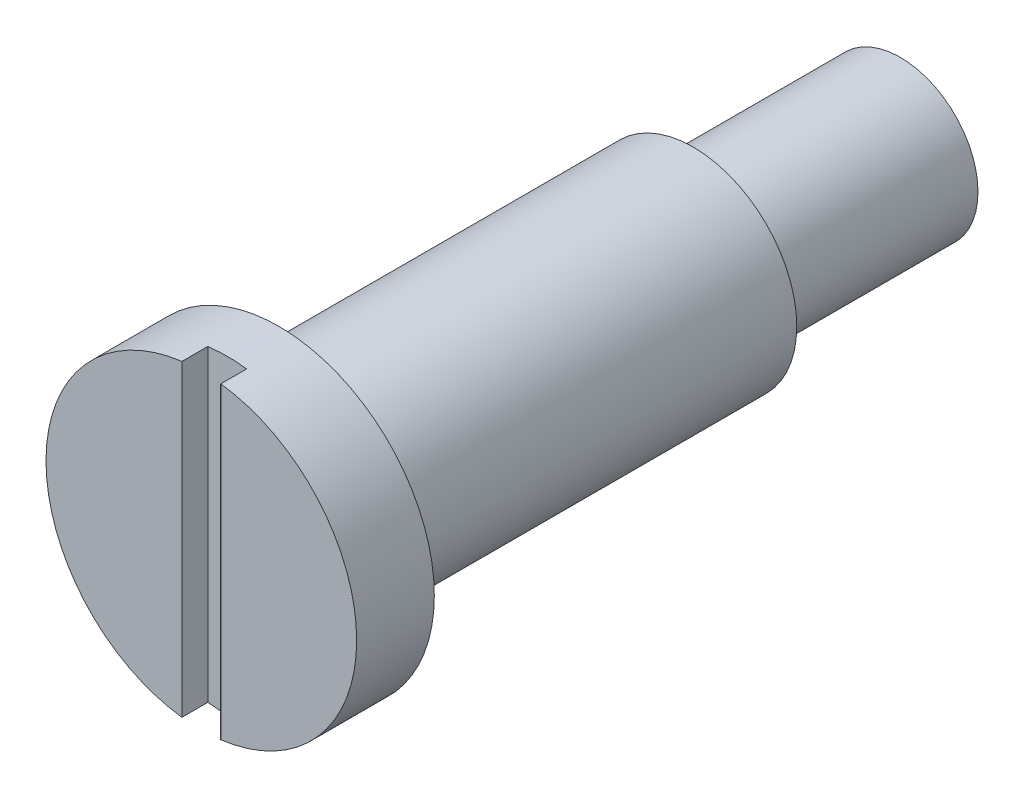
ISO-10303-21;
HEADER;
FILE_DESCRIPTION(('STEP AP214'),'2;1');
FILE_NAME('part.step','',(''),(''),'','','');
FILE_SCHEMA(('AUTOMOTIVE_DESIGN { 1 0 10303 214 1 1 1 1 }'));
ENDSEC;
DATA;
#1=APPLICATION_CONTEXT('core data for automotive mechanical design processes');
#2=APPLICATION_PROTOCOL_DEFINITION('international standard','automotive_design',2000,#1);
#3=PRODUCT_CONTEXT('',#1,'mechanical');
#4=PRODUCT('Part','Part','',(#3));
#5=PRODUCT_RELATED_PRODUCT_CATEGORY('part','',(#4));
#6=PRODUCT_DEFINITION_FORMATION('','',#4);
#7=PRODUCT_DEFINITION_CONTEXT('part definition',#1,'design');
#8=PRODUCT_DEFINITION('design','',#6,#7);
#9=PRODUCT_DEFINITION_SHAPE('','',#8);
#10=(LENGTH_UNIT() NAMED_UNIT(*) SI_UNIT(.MILLI.,.METRE.));
#11=(NAMED_UNIT(*) PLANE_ANGLE_UNIT() SI_UNIT($,.RADIAN.));
#12=(NAMED_UNIT(*) SI_UNIT($,.STERADIAN.) SOLID_ANGLE_UNIT());
#13=UNCERTAINTY_MEASURE_WITH_UNIT(LENGTH_MEASURE(1.E-05),#10,'distance_accuracy_value','');
#14=(GEOMETRIC_REPRESENTATION_CONTEXT(3) GLOBAL_UNCERTAINTY_ASSIGNED_CONTEXT((#13)) GLOBAL_UNIT_ASSIGNED_CONTEXT((#10,
#11,#12)) REPRESENTATION_CONTEXT('',''));
#15=CARTESIAN_POINT('',(0.,0.,0.));
#16=DIRECTION('',(0.,0.,1.));
#17=DIRECTION('',(1.,0.,0.));
#18=AXIS2_PLACEMENT_3D('',#15,#16,#17);
#19=CARTESIAN_POINT('',(0.,0.,0.));
#20=DIRECTION('',(0.,0.,-1.));
#21=DIRECTION('',(-1.,0.,0.));
#22=AXIS2_PLACEMENT_3D('',#19,#20,#21);
#23=PLANE('',#22);
#24=CARTESIAN_POINT('',(0.,0.,0.));
#25=DIRECTION('',(0.,0.,1.));
#26=DIRECTION('',(1.,0.,0.));
#27=AXIS2_PLACEMENT_3D('',#24,#25,#26);
#28=CIRCLE('',#27,6.);
#29=CARTESIAN_POINT('',(-0.75,5.95294044989533,0.));
#30=VERTEX_POINT('',#29);
#31=CARTESIAN_POINT('',(-0.749999999999998,-5.95294044989533,0.));
#32=VERTEX_POINT('',#31);
#33=EDGE_CURVE('E86',#30,#32,#28,.T.);
#34=ORIENTED_EDGE('',*,*,#33,.T.);
#35=DIRECTION('',(0.,-1.,0.));
#36=VECTOR('',#35,1.);
#37=CARTESIAN_POINT('',(-0.75,6.,0.));
#38=LINE('',#37,#36);
#39=EDGE_CURVE('E80',#30,#32,#38,.T.);
#40=ORIENTED_EDGE('',*,*,#39,.F.);
#41=EDGE_LOOP('',(#34,#40));
#42=FACE_BOUND('',#41,.T.);
#43=ADVANCED_FACE('F36',(#42),#23,.F.);
#44=CARTESIAN_POINT('',(0.750000000000001,-5.95294044989533,0.));
#45=VERTEX_POINT('',#44);
#46=CARTESIAN_POINT('',(0.75,5.95294044989533,0.));
#47=VERTEX_POINT('',#46);
#48=EDGE_CURVE('E92',#45,#47,#28,.T.);
#49=ORIENTED_EDGE('',*,*,#48,.T.);
#50=DIRECTION('',(0.,1.,0.));
#51=VECTOR('',#50,1.);
#52=CARTESIAN_POINT('',(0.75,6.,0.));
#53=LINE('',#52,#51);
#54=EDGE_CURVE('E87',#45,#47,#53,.T.);
#55=ORIENTED_EDGE('',*,*,#54,.F.);
#56=EDGE_LOOP('',(#49,#55));
#57=FACE_BOUND('',#56,.T.);
#58=ADVANCED_FACE('F38',(#57),#23,.F.);
#59=CARTESIAN_POINT('',(0.,0.,0.));
#60=DIRECTION('',(0.,0.,1.));
#61=DIRECTION('',(1.,0.,0.));
#62=AXIS2_PLACEMENT_3D('',#59,#60,#61);
#63=CYLINDRICAL_SURFACE('',#62,6.);
#64=ORIENTED_EDGE('',*,*,#33,.F.);
#65=DIRECTION('',(0.,0.,1.));
#66=VECTOR('',#65,1.);
#67=CARTESIAN_POINT('',(-0.75,5.95294044989533,0.));
#68=LINE('',#67,#66);
#69=CARTESIAN_POINT('',(-0.75,5.95294044989533,-1.));
#70=VERTEX_POINT('',#69);
#71=EDGE_CURVE('E11',#30,#70,#68,.F.);
#72=ORIENTED_EDGE('',*,*,#71,.T.);
#73=CARTESIAN_POINT('',(0.,0.,-1.));
#74=DIRECTION('',(0.,0.,1.));
#75=DIRECTION('',(1.,0.,0.));
#76=AXIS2_PLACEMENT_3D('',#73,#74,#75);
#77=CIRCLE('',#76,6.);
#78=CARTESIAN_POINT('',(0.75,5.95294044989533,-1.));
#79=VERTEX_POINT('',#78);
#80=EDGE_CURVE('E50',#79,#70,#77,.T.);
#81=ORIENTED_EDGE('',*,*,#80,.F.);
#82=DIRECTION('',(0.,0.,1.));
#83=VECTOR('',#82,1.);
#84=CARTESIAN_POINT('',(0.75,5.95294044989533,0.));
#85=LINE('',#84,#83);
#86=EDGE_CURVE('E44',#79,#47,#85,.T.);
#87=ORIENTED_EDGE('',*,*,#86,.T.);
#88=ORIENTED_EDGE('',*,*,#48,.F.);
#89=DIRECTION('',(0.,0.,1.));
#90=VECTOR('',#89,1.);
#91=CARTESIAN_POINT('',(0.750000000000002,-5.95294044989533,0.));
#92=LINE('',#91,#90);
#93=CARTESIAN_POINT('',(0.750000000000001,-5.95294044989533,-1.));
#94=VERTEX_POINT('',#93);
#95=EDGE_CURVE('E94',#45,#94,#92,.F.);
#96=ORIENTED_EDGE('',*,*,#95,.T.);
#97=CARTESIAN_POINT('',(-0.749999999999998,-5.95294044989533,-1.));
#98=VERTEX_POINT('',#97);
#99=EDGE_CURVE('E58',#98,#94,#77,.T.);
#100=ORIENTED_EDGE('',*,*,#99,.F.);
#101=DIRECTION('',(0.,0.,1.));
#102=VECTOR('',#101,1.);
#103=CARTESIAN_POINT('',(-0.749999999999998,-5.95294044989533,0.));
#104=LINE('',#103,#102);
#105=EDGE_CURVE('E91',#98,#32,#104,.T.);
#106=ORIENTED_EDGE('',*,*,#105,.T.);
#107=EDGE_LOOP('',(#64,#72,#81,#87,#88,#96,#100,#106));
#108=FACE_BOUND('',#107,.T.);
#109=CARTESIAN_POINT('',(0.,0.,-3.));
#110=DIRECTION('',(0.,0.,1.));
#111=DIRECTION('',(1.,0.,0.));
#112=AXIS2_PLACEMENT_3D('',#109,#110,#111);
#113=CIRCLE('',#112,6.);
#114=CARTESIAN_POINT('',(6.,0.,-3.));
#115=VERTEX_POINT('',#114);
#116=EDGE_CURVE('E97',#115,#115,#113,.T.);
#117=ORIENTED_EDGE('',*,*,#116,.T.);
#118=EDGE_LOOP('',(#117));
#119=FACE_BOUND('',#118,.T.);
#120=ADVANCED_FACE('F89',(#108,#119),#63,.T.);
#121=CARTESIAN_POINT('',(0.,6.,-3.));
#122=DIRECTION('',(0.,0.,1.));
#123=DIRECTION('',(1.,0.,0.));
#124=AXIS2_PLACEMENT_3D('',#121,#122,#123);
#125=PLANE('',#124);
#126=ORIENTED_EDGE('',*,*,#116,.F.);
#127=EDGE_LOOP('',(#126));
#128=FACE_BOUND('',#127,.T.);
#129=CARTESIAN_POINT('',(0.,0.,-3.));
#130=DIRECTION('',(0.,0.,1.));
#131=DIRECTION('',(1.,0.,0.));
#132=AXIS2_PLACEMENT_3D('',#129,#130,#131);
#133=CIRCLE('',#132,4.);
#134=CARTESIAN_POINT('',(4.,0.,-3.));
#135=VERTEX_POINT('',#134);
#136=EDGE_CURVE('E119',#135,#135,#133,.T.);
#137=ORIENTED_EDGE('',*,*,#136,.T.);
#138=EDGE_LOOP('',(#137));
#139=FACE_BOUND('',#138,.T.);
#140=ADVANCED_FACE('F126',(#128,#139),#125,.F.);
#141=CARTESIAN_POINT('',(0.,0.,0.));
#142=DIRECTION('',(0.,0.,1.));
#143=DIRECTION('',(1.,0.,0.));
#144=AXIS2_PLACEMENT_3D('',#141,#142,#143);
#145=CYLINDRICAL_SURFACE('',#144,4.);
#146=ORIENTED_EDGE('',*,*,#136,.F.);
#147=EDGE_LOOP('',(#146));
#148=FACE_BOUND('',#147,.T.);
#149=CARTESIAN_POINT('',(0.,0.,-19.));
#150=DIRECTION('',(0.,0.,1.));
#151=DIRECTION('',(1.,0.,0.));
#152=AXIS2_PLACEMENT_3D('',#149,#150,#151);
#153=CIRCLE('',#152,4.);
#154=CARTESIAN_POINT('',(4.,0.,-19.));
#155=VERTEX_POINT('',#154);
#156=EDGE_CURVE('E117',#155,#155,#153,.T.);
#157=ORIENTED_EDGE('',*,*,#156,.T.);
#158=EDGE_LOOP('',(#157));
#159=FACE_BOUND('',#158,.T.);
#160=ADVANCED_FACE('F128',(#148,#159),#145,.T.);
#161=CARTESIAN_POINT('',(0.,4.,-19.));
#162=DIRECTION('',(0.,0.,1.));
#163=DIRECTION('',(1.,0.,0.));
#164=AXIS2_PLACEMENT_3D('',#161,#162,#163);
#165=PLANE('',#164);
#166=ORIENTED_EDGE('',*,*,#156,.F.);
#167=EDGE_LOOP('',(#166));
#168=FACE_BOUND('',#167,.T.);
#169=CARTESIAN_POINT('',(0.,0.,-19.));
#170=DIRECTION('',(0.,0.,1.));
#171=DIRECTION('',(1.,0.,0.));
#172=AXIS2_PLACEMENT_3D('',#169,#170,#171);
#173=CIRCLE('',#172,3.);
#174=CARTESIAN_POINT('',(3.,0.,-19.));
#175=VERTEX_POINT('',#174);
#176=EDGE_CURVE('E110',#175,#175,#173,.T.);
#177=ORIENTED_EDGE('',*,*,#176,.T.);
#178=EDGE_LOOP('',(#177));
#179=FACE_BOUND('',#178,.T.);
#180=ADVANCED_FACE('F134',(#168,#179),#165,.F.);
#181=CARTESIAN_POINT('',(0.,0.,0.));
#182=DIRECTION('',(0.,0.,1.));
#183=DIRECTION('',(1.,0.,0.));
#184=AXIS2_PLACEMENT_3D('',#181,#182,#183);
#185=CYLINDRICAL_SURFACE('',#184,3.);
#186=ORIENTED_EDGE('',*,*,#176,.F.);
#187=EDGE_LOOP('',(#186));
#188=FACE_BOUND('',#187,.T.);
#189=CARTESIAN_POINT('',(0.,0.,-27.));
#190=DIRECTION('',(0.,0.,1.));
#191=DIRECTION('',(1.,0.,0.));
#192=AXIS2_PLACEMENT_3D('',#189,#190,#191);
#193=CIRCLE('',#192,3.);
#194=CARTESIAN_POINT('',(3.,0.,-27.));
#195=VERTEX_POINT('',#194);
#196=EDGE_CURVE('E107',#195,#195,#193,.T.);
#197=ORIENTED_EDGE('',*,*,#196,.T.);
#198=EDGE_LOOP('',(#197));
#199=FACE_BOUND('',#198,.T.);
#200=ADVANCED_FACE('F158',(#188,#199),#185,.T.);
#201=CARTESIAN_POINT('',(0.,3.,-27.));
#202=DIRECTION('',(0.,0.,1.));
#203=DIRECTION('',(1.,0.,0.));
#204=AXIS2_PLACEMENT_3D('',#201,#202,#203);
#205=PLANE('',#204);
#206=ORIENTED_EDGE('',*,*,#196,.F.);
#207=EDGE_LOOP('',(#206));
#208=FACE_BOUND('',#207,.T.);
#209=ADVANCED_FACE('F153',(#208),#205,.F.);
#210=CARTESIAN_POINT('',(-0.75,6.,-1.));
#211=DIRECTION('',(-1.,0.,0.));
#212=DIRECTION('',(0.,-1.,0.));
#213=AXIS2_PLACEMENT_3D('',#210,#211,#212);
#214=PLANE('',#213);
#215=DIRECTION('',(0.,-1.,0.));
#216=VECTOR('',#215,1.);
#217=CARTESIAN_POINT('',(-0.75,6.,-1.));
#218=LINE('',#217,#216);
#219=EDGE_CURVE('E82',#70,#98,#218,.T.);
#220=ORIENTED_EDGE('',*,*,#219,.F.);
#221=ORIENTED_EDGE('',*,*,#71,.F.);
#222=ORIENTED_EDGE('',*,*,#39,.T.);
#223=ORIENTED_EDGE('',*,*,#105,.F.);
#224=EDGE_LOOP('',(#220,#221,#222,#223));
#225=FACE_BOUND('',#224,.T.);
#226=ADVANCED_FACE('F78',(#225),#214,.F.);
#227=CARTESIAN_POINT('',(0.75,6.,-1.));
#228=DIRECTION('',(1.,0.,0.));
#229=DIRECTION('',(0.,1.,0.));
#230=AXIS2_PLACEMENT_3D('',#227,#228,#229);
#231=PLANE('',#230);
#232=DIRECTION('',(0.,1.,0.));
#233=VECTOR('',#232,1.);
#234=CARTESIAN_POINT('',(0.75,6.,-1.));
#235=LINE('',#234,#233);
#236=EDGE_CURVE('E105',#94,#79,#235,.T.);
#237=ORIENTED_EDGE('',*,*,#236,.F.);
#238=ORIENTED_EDGE('',*,*,#95,.F.);
#239=ORIENTED_EDGE('',*,*,#54,.T.);
#240=ORIENTED_EDGE('',*,*,#86,.F.);
#241=EDGE_LOOP('',(#237,#238,#239,#240));
#242=FACE_BOUND('',#241,.T.);
#243=ADVANCED_FACE('F145',(#242),#231,.F.);
#244=CARTESIAN_POINT('',(0.,0.,-1.));
#245=DIRECTION('',(0.,0.,1.));
#246=DIRECTION('',(1.,0.,0.));
#247=AXIS2_PLACEMENT_3D('',#244,#245,#246);
#248=PLANE('',#247);
#249=ORIENTED_EDGE('',*,*,#236,.T.);
#250=ORIENTED_EDGE('',*,*,#80,.T.);
#251=ORIENTED_EDGE('',*,*,#219,.T.);
#252=ORIENTED_EDGE('',*,*,#99,.T.);
#253=EDGE_LOOP('',(#249,#250,#251,#252));
#254=FACE_BOUND('',#253,.T.);
#255=ADVANCED_FACE('F104',(#254),#248,.T.);
#256=CLOSED_SHELL('',(#43,#58,#120,#140,#160,#180,#200,#209,#226,#243,#255));
#257=MANIFOLD_SOLID_BREP('B2',#256);
#258=ADVANCED_BREP_SHAPE_REPRESENTATION('',(#18,#257),#14);
#259=SHAPE_DEFINITION_REPRESENTATION(#9,#258);
ENDSEC;
END-ISO-10303-21;
